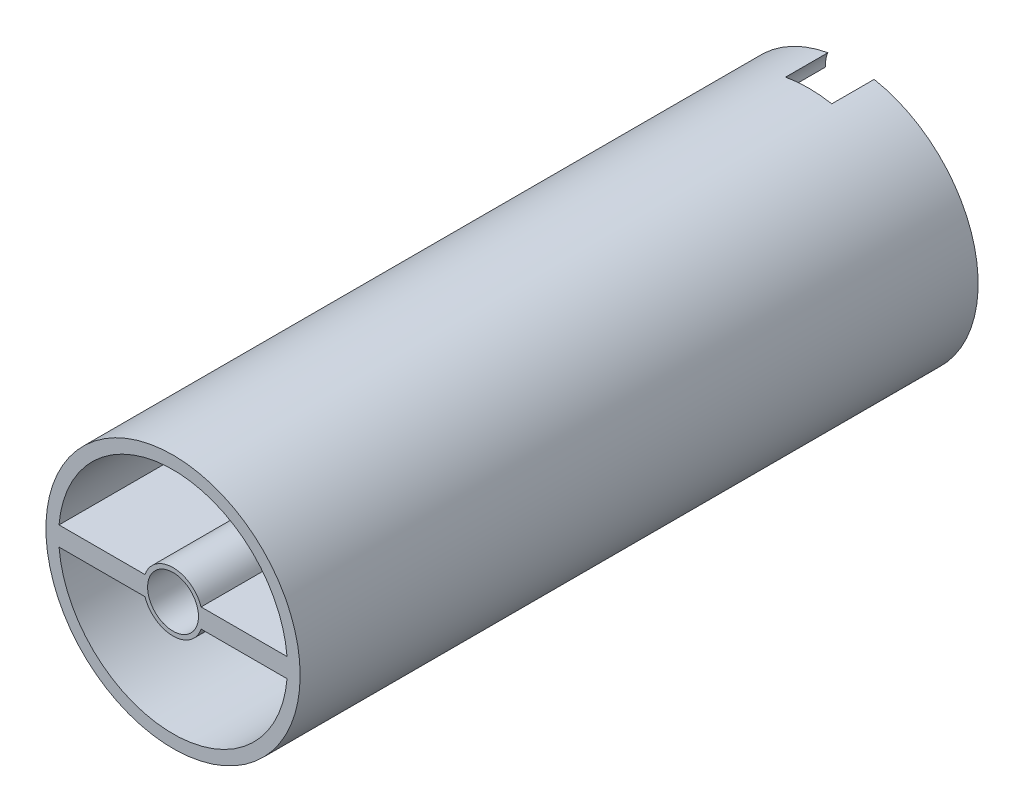
ISO-10303-21;
HEADER;
FILE_DESCRIPTION(('STEP AP214'),'2;1');
FILE_NAME('part.step','',(''),(''),'','','');
FILE_SCHEMA(('AUTOMOTIVE_DESIGN { 1 0 10303 214 1 1 1 1 }'));
ENDSEC;
DATA;
#1=APPLICATION_CONTEXT('core data for automotive mechanical design processes');
#2=APPLICATION_PROTOCOL_DEFINITION('international standard','automotive_design',2000,#1);
#3=PRODUCT_CONTEXT('',#1,'mechanical');
#4=PRODUCT('Part','Part','',(#3));
#5=PRODUCT_RELATED_PRODUCT_CATEGORY('part','',(#4));
#6=PRODUCT_DEFINITION_FORMATION('','',#4);
#7=PRODUCT_DEFINITION_CONTEXT('part definition',#1,'design');
#8=PRODUCT_DEFINITION('design','',#6,#7);
#9=PRODUCT_DEFINITION_SHAPE('','',#8);
#10=(LENGTH_UNIT() NAMED_UNIT(*) SI_UNIT(.MILLI.,.METRE.));
#11=(NAMED_UNIT(*) PLANE_ANGLE_UNIT() SI_UNIT($,.RADIAN.));
#12=(NAMED_UNIT(*) SI_UNIT($,.STERADIAN.) SOLID_ANGLE_UNIT());
#13=UNCERTAINTY_MEASURE_WITH_UNIT(LENGTH_MEASURE(1.E-05),#10,'distance_accuracy_value','');
#14=(GEOMETRIC_REPRESENTATION_CONTEXT(3) GLOBAL_UNCERTAINTY_ASSIGNED_CONTEXT((#13)) GLOBAL_UNIT_ASSIGNED_CONTEXT((#10,
#11,#12)) REPRESENTATION_CONTEXT('',''));
#15=CARTESIAN_POINT('',(0.,0.,0.));
#16=DIRECTION('',(0.,0.,1.));
#17=DIRECTION('',(1.,0.,0.));
#18=AXIS2_PLACEMENT_3D('',#15,#16,#17);
#19=CARTESIAN_POINT('',(0.,0.,80.));
#20=DIRECTION('',(0.,0.,-1.));
#21=DIRECTION('',(-1.,0.,0.));
#22=AXIS2_PLACEMENT_3D('',#19,#20,#21);
#23=CYLINDRICAL_SURFACE('',#22,13.5);
#24=CARTESIAN_POINT('',(0.,0.,0.));
#25=DIRECTION('',(0.,0.,1.));
#26=DIRECTION('',(1.,0.,0.));
#27=AXIS2_PLACEMENT_3D('',#24,#25,#26);
#28=CIRCLE('',#27,13.5);
#29=CARTESIAN_POINT('',(-2.98142396999973,13.1666666666667,0.));
#30=VERTEX_POINT('',#29);
#31=CARTESIAN_POINT('',(-13.4525879257289,1.13043270500024,0.));
#32=VERTEX_POINT('',#31);
#33=EDGE_CURVE('E331',#30,#32,#28,.T.);
#34=ORIENTED_EDGE('',*,*,#33,.F.);
#35=DIRECTION('',(0.,0.,-1.));
#36=VECTOR('',#35,1.);
#37=CARTESIAN_POINT('',(-2.98142396999973,13.1666666666667,5.));
#38=LINE('',#37,#36);
#39=CARTESIAN_POINT('',(-2.98142396999973,13.1666666666667,5.));
#40=VERTEX_POINT('',#39);
#41=EDGE_CURVE('E235',#40,#30,#38,.T.);
#42=ORIENTED_EDGE('',*,*,#41,.F.);
#43=CARTESIAN_POINT('',(0.,0.,5.));
#44=DIRECTION('',(0.,0.,1.));
#45=DIRECTION('',(1.,0.,0.));
#46=AXIS2_PLACEMENT_3D('',#43,#44,#45);
#47=CIRCLE('',#46,13.5);
#48=CARTESIAN_POINT('',(2.98142396999973,13.1666666666667,5.));
#49=VERTEX_POINT('',#48);
#50=EDGE_CURVE('E219',#49,#40,#47,.T.);
#51=ORIENTED_EDGE('',*,*,#50,.F.);
#52=DIRECTION('',(0.,0.,-1.));
#53=VECTOR('',#52,1.);
#54=CARTESIAN_POINT('',(2.98142396999973,13.1666666666667,5.));
#55=LINE('',#54,#53);
#56=CARTESIAN_POINT('',(2.98142396999973,13.1666666666667,0.));
#57=VERTEX_POINT('',#56);
#58=EDGE_CURVE('E251',#49,#57,#55,.T.);
#59=ORIENTED_EDGE('',*,*,#58,.T.);
#60=CARTESIAN_POINT('',(13.4525879257289,1.13043270500024,0.));
#61=VERTEX_POINT('',#60);
#62=EDGE_CURVE('E326',#61,#57,#28,.T.);
#63=ORIENTED_EDGE('',*,*,#62,.F.);
#64=DIRECTION('',(0.,0.,-1.));
#65=VECTOR('',#64,1.);
#66=CARTESIAN_POINT('',(13.4525879257289,1.13043270500024,80.));
#67=LINE('',#66,#65);
#68=CARTESIAN_POINT('',(13.4525879257289,1.13043270500024,55.));
#69=VERTEX_POINT('',#68);
#70=EDGE_CURVE('E388',#69,#61,#67,.T.);
#71=ORIENTED_EDGE('',*,*,#70,.F.);
#72=CARTESIAN_POINT('',(0.,0.,55.));
#73=DIRECTION('',(0.,0.,1.));
#74=DIRECTION('',(1.,0.,0.));
#75=AXIS2_PLACEMENT_3D('',#72,#73,#74);
#76=CIRCLE('',#75,13.5);
#77=CARTESIAN_POINT('',(-13.4525879257289,1.13043270500024,55.));
#78=VERTEX_POINT('',#77);
#79=EDGE_CURVE('E447',#69,#78,#76,.T.);
#80=ORIENTED_EDGE('',*,*,#79,.T.);
#81=DIRECTION('',(0.,0.,-1.));
#82=VECTOR('',#81,1.);
#83=CARTESIAN_POINT('',(-13.4525879257289,1.13043270500024,80.));
#84=LINE('',#83,#82);
#85=EDGE_CURVE('E320',#78,#32,#84,.T.);
#86=ORIENTED_EDGE('',*,*,#85,.T.);
#87=EDGE_LOOP('',(#34,#42,#51,#59,#63,#71,#80,#86));
#88=FACE_BOUND('',#87,.T.);
#89=ADVANCED_FACE('F48',(#88),#23,.F.);
#90=CARTESIAN_POINT('',(0.,0.,80.));
#91=DIRECTION('',(0.,0.,-1.));
#92=DIRECTION('',(-1.,0.,0.));
#93=AXIS2_PLACEMENT_3D('',#90,#91,#92);
#94=CYLINDRICAL_SURFACE('',#93,15.);
#95=CARTESIAN_POINT('',(0.,0.,80.));
#96=DIRECTION('',(0.,0.,1.));
#97=DIRECTION('',(1.,0.,0.));
#98=AXIS2_PLACEMENT_3D('',#95,#96,#97);
#99=CIRCLE('',#98,15.);
#100=CARTESIAN_POINT('',(15.,0.,80.));
#101=VERTEX_POINT('',#100);
#102=EDGE_CURVE('E286',#101,#101,#99,.T.);
#103=ORIENTED_EDGE('',*,*,#102,.F.);
#104=EDGE_LOOP('',(#103));
#105=FACE_BOUND('',#104,.T.);
#106=DIRECTION('',(0.,0.,-1.));
#107=VECTOR('',#106,1.);
#108=CARTESIAN_POINT('',(-2.72717802865893,14.75,5.));
#109=LINE('',#108,#107);
#110=CARTESIAN_POINT('',(-2.72717802865893,14.75,5.));
#111=VERTEX_POINT('',#110);
#112=CARTESIAN_POINT('',(-2.72717802865893,14.75,0.));
#113=VERTEX_POINT('',#112);
#114=EDGE_CURVE('E226',#111,#113,#109,.T.);
#115=ORIENTED_EDGE('',*,*,#114,.T.);
#116=CARTESIAN_POINT('',(0.,0.,0.));
#117=DIRECTION('',(0.,0.,1.));
#118=DIRECTION('',(1.,0.,0.));
#119=AXIS2_PLACEMENT_3D('',#116,#117,#118);
#120=CIRCLE('',#119,15.);
#121=CARTESIAN_POINT('',(-2.72717802865893,-14.75,0.));
#122=VERTEX_POINT('',#121);
#123=EDGE_CURVE('E324',#113,#122,#120,.T.);
#124=ORIENTED_EDGE('',*,*,#123,.T.);
#125=DIRECTION('',(0.,0.,-1.));
#126=VECTOR('',#125,1.);
#127=CARTESIAN_POINT('',(-2.72717802865893,-14.75,5.));
#128=LINE('',#127,#126);
#129=CARTESIAN_POINT('',(-2.72717802865893,-14.75,5.));
#130=VERTEX_POINT('',#129);
#131=EDGE_CURVE('E248',#130,#122,#128,.T.);
#132=ORIENTED_EDGE('',*,*,#131,.F.);
#133=CARTESIAN_POINT('',(0.,0.,5.));
#134=DIRECTION('',(0.,0.,1.));
#135=DIRECTION('',(1.,0.,0.));
#136=AXIS2_PLACEMENT_3D('',#133,#134,#135);
#137=CIRCLE('',#136,15.);
#138=CARTESIAN_POINT('',(2.72717802865893,-14.75,5.));
#139=VERTEX_POINT('',#138);
#140=EDGE_CURVE('E261',#130,#139,#137,.T.);
#141=ORIENTED_EDGE('',*,*,#140,.T.);
#142=DIRECTION('',(0.,0.,-1.));
#143=VECTOR('',#142,1.);
#144=CARTESIAN_POINT('',(2.72717802865893,-14.75,5.));
#145=LINE('',#144,#143);
#146=CARTESIAN_POINT('',(2.72717802865893,-14.75,0.));
#147=VERTEX_POINT('',#146);
#148=EDGE_CURVE('E280',#139,#147,#145,.T.);
#149=ORIENTED_EDGE('',*,*,#148,.T.);
#150=CARTESIAN_POINT('',(2.72717802865893,14.75,0.));
#151=VERTEX_POINT('',#150);
#152=EDGE_CURVE('E321',#147,#151,#120,.T.);
#153=ORIENTED_EDGE('',*,*,#152,.T.);
#154=DIRECTION('',(0.,0.,-1.));
#155=VECTOR('',#154,1.);
#156=CARTESIAN_POINT('',(2.72717802865893,14.75,5.));
#157=LINE('',#156,#155);
#158=CARTESIAN_POINT('',(2.72717802865893,14.75,5.));
#159=VERTEX_POINT('',#158);
#160=EDGE_CURVE('E74',#159,#151,#157,.T.);
#161=ORIENTED_EDGE('',*,*,#160,.F.);
#162=CARTESIAN_POINT('',(0.,0.,5.));
#163=DIRECTION('',(0.,0.,1.));
#164=DIRECTION('',(1.,0.,0.));
#165=AXIS2_PLACEMENT_3D('',#162,#163,#164);
#166=CIRCLE('',#165,15.);
#167=EDGE_CURVE('E217',#159,#111,#166,.T.);
#168=ORIENTED_EDGE('',*,*,#167,.T.);
#169=EDGE_LOOP('',(#115,#124,#132,#141,#149,#153,#161,#168));
#170=FACE_BOUND('',#169,.T.);
#171=ADVANCED_FACE('F237',(#105,#170),#94,.T.);
#172=CARTESIAN_POINT('',(0.,0.,0.));
#173=DIRECTION('',(0.,0.,1.));
#174=DIRECTION('',(1.,0.,0.));
#175=AXIS2_PLACEMENT_3D('',#172,#173,#174);
#176=PLANE('',#175);
#177=CARTESIAN_POINT('',(0.,0.,0.));
#178=DIRECTION('',(0.,0.,1.));
#179=DIRECTION('',(1.,0.,0.));
#180=AXIS2_PLACEMENT_3D('',#177,#178,#179);
#181=CIRCLE('',#180,3.);
#182=CARTESIAN_POINT('',(3.,0.,0.));
#183=VERTEX_POINT('',#182);
#184=EDGE_CURVE('E291',#183,#183,#181,.T.);
#185=ORIENTED_EDGE('',*,*,#184,.T.);
#186=EDGE_LOOP('',(#185));
#187=FACE_BOUND('',#186,.T.);
#188=CARTESIAN_POINT('',(0.,13.5,0.));
#189=DIRECTION('',(0.,0.,1.));
#190=DIRECTION('',(1.,0.,0.));
#191=AXIS2_PLACEMENT_3D('',#188,#189,#190);
#192=CIRCLE('',#191,3.);
#193=EDGE_CURVE('E229',#113,#30,#192,.T.);
#194=ORIENTED_EDGE('',*,*,#193,.T.);
#195=ORIENTED_EDGE('',*,*,#33,.T.);
#196=DIRECTION('',(1.,0.,0.));
#197=VECTOR('',#196,1.);
#198=CARTESIAN_POINT('',(0.,1.13043270500024,0.));
#199=LINE('',#198,#197);
#200=CARTESIAN_POINT('',(-3.31241934233361,1.13043270500024,0.));
#201=VERTEX_POINT('',#200);
#202=EDGE_CURVE('E341',#32,#201,#199,.T.);
#203=ORIENTED_EDGE('',*,*,#202,.T.);
#204=CARTESIAN_POINT('',(0.,0.,0.));
#205=DIRECTION('',(0.,0.,1.));
#206=DIRECTION('',(1.,0.,0.));
#207=AXIS2_PLACEMENT_3D('',#204,#205,#206);
#208=CIRCLE('',#207,3.5);
#209=CARTESIAN_POINT('',(3.31241934233361,1.13043270500024,0.));
#210=VERTEX_POINT('',#209);
#211=EDGE_CURVE('E337',#210,#201,#208,.T.);
#212=ORIENTED_EDGE('',*,*,#211,.F.);
#213=DIRECTION('',(1.,0.,0.));
#214=VECTOR('',#213,1.);
#215=CARTESIAN_POINT('',(0.,1.13043270500024,0.));
#216=LINE('',#215,#214);
#217=EDGE_CURVE('E330',#210,#61,#216,.T.);
#218=ORIENTED_EDGE('',*,*,#217,.T.);
#219=ORIENTED_EDGE('',*,*,#62,.T.);
#220=EDGE_CURVE('E240',#57,#151,#192,.T.);
#221=ORIENTED_EDGE('',*,*,#220,.T.);
#222=ORIENTED_EDGE('',*,*,#152,.F.);
#223=CARTESIAN_POINT('',(0.,-13.5,0.));
#224=DIRECTION('',(0.,0.,1.));
#225=DIRECTION('',(1.,0.,0.));
#226=AXIS2_PLACEMENT_3D('',#223,#224,#225);
#227=CIRCLE('',#226,3.);
#228=CARTESIAN_POINT('',(2.98142396999973,-13.1666666666667,0.));
#229=VERTEX_POINT('',#228);
#230=EDGE_CURVE('E262',#229,#147,#227,.F.);
#231=ORIENTED_EDGE('',*,*,#230,.F.);
#232=CARTESIAN_POINT('',(13.4525879257289,-1.13043270500035,0.));
#233=VERTEX_POINT('',#232);
#234=EDGE_CURVE('E332',#229,#233,#28,.T.);
#235=ORIENTED_EDGE('',*,*,#234,.T.);
#236=DIRECTION('',(1.,0.,0.));
#237=VECTOR('',#236,1.);
#238=CARTESIAN_POINT('',(0.,-1.13043270500035,0.));
#239=LINE('',#238,#237);
#240=CARTESIAN_POINT('',(3.31241934233361,-1.13043270500035,0.));
#241=VERTEX_POINT('',#240);
#242=EDGE_CURVE('E345',#241,#233,#239,.T.);
#243=ORIENTED_EDGE('',*,*,#242,.F.);
#244=CARTESIAN_POINT('',(0.,0.,0.));
#245=DIRECTION('',(0.,0.,1.));
#246=DIRECTION('',(1.,0.,0.));
#247=AXIS2_PLACEMENT_3D('',#244,#245,#246);
#248=CIRCLE('',#247,3.50000000000004);
#249=CARTESIAN_POINT('',(-3.31241934233361,-1.13043270500035,0.));
#250=VERTEX_POINT('',#249);
#251=EDGE_CURVE('E353',#250,#241,#248,.T.);
#252=ORIENTED_EDGE('',*,*,#251,.F.);
#253=DIRECTION('',(1.,0.,0.));
#254=VECTOR('',#253,1.);
#255=CARTESIAN_POINT('',(0.,-1.13043270500035,0.));
#256=LINE('',#255,#254);
#257=CARTESIAN_POINT('',(-13.4525879257289,-1.13043270500035,0.));
#258=VERTEX_POINT('',#257);
#259=EDGE_CURVE('E349',#258,#250,#256,.T.);
#260=ORIENTED_EDGE('',*,*,#259,.F.);
#261=CARTESIAN_POINT('',(-2.98142396999973,-13.1666666666667,0.));
#262=VERTEX_POINT('',#261);
#263=EDGE_CURVE('E333',#258,#262,#28,.T.);
#264=ORIENTED_EDGE('',*,*,#263,.T.);
#265=EDGE_CURVE('E272',#122,#262,#227,.F.);
#266=ORIENTED_EDGE('',*,*,#265,.F.);
#267=ORIENTED_EDGE('',*,*,#123,.F.);
#268=EDGE_LOOP('',(#194,#195,#203,#212,#218,#219,#221,#222,#231,#235,#243,#252,#260,#264,#266,#267));
#269=FACE_BOUND('',#268,.T.);
#270=ADVANCED_FACE('F513',(#187,#269),#176,.F.);
#271=CARTESIAN_POINT('',(0.,-1.13043270500035,80.));
#272=DIRECTION('',(0.,1.,0.));
#273=DIRECTION('',(0.,0.,1.));
#274=AXIS2_PLACEMENT_3D('',#271,#272,#273);
#275=PLANE('',#274);
#276=DIRECTION('',(1.,0.,0.));
#277=VECTOR('',#276,1.);
#278=CARTESIAN_POINT('',(0.,-1.13043270500035,55.));
#279=LINE('',#278,#277);
#280=CARTESIAN_POINT('',(3.31241934233361,-1.13043270500035,55.));
#281=VERTEX_POINT('',#280);
#282=CARTESIAN_POINT('',(13.4525879257289,-1.13043270500035,55.));
#283=VERTEX_POINT('',#282);
#284=EDGE_CURVE('E398',#281,#283,#279,.T.);
#285=ORIENTED_EDGE('',*,*,#284,.F.);
#286=DIRECTION('',(0.,0.,-1.));
#287=VECTOR('',#286,1.);
#288=CARTESIAN_POINT('',(3.31241934233361,-1.13043270500035,80.));
#289=LINE('',#288,#287);
#290=EDGE_CURVE('E365',#281,#241,#289,.T.);
#291=ORIENTED_EDGE('',*,*,#290,.T.);
#292=ORIENTED_EDGE('',*,*,#242,.T.);
#293=DIRECTION('',(0.,0.,-1.));
#294=VECTOR('',#293,1.);
#295=CARTESIAN_POINT('',(13.4525879257289,-1.13043270500035,80.));
#296=LINE('',#295,#294);
#297=EDGE_CURVE('E58',#283,#233,#296,.T.);
#298=ORIENTED_EDGE('',*,*,#297,.F.);
#299=EDGE_LOOP('',(#285,#291,#292,#298));
#300=FACE_BOUND('',#299,.T.);
#301=ADVANCED_FACE('F520',(#300),#275,.F.);
#302=DIRECTION('',(0.,0.,-1.));
#303=VECTOR('',#302,1.);
#304=CARTESIAN_POINT('',(-2.98142396999973,-13.1666666666667,5.));
#305=LINE('',#304,#303);
#306=CARTESIAN_POINT('',(-2.98142396999973,-13.1666666666667,5.));
#307=VERTEX_POINT('',#306);
#308=EDGE_CURVE('E271',#307,#262,#305,.T.);
#309=ORIENTED_EDGE('',*,*,#308,.T.);
#310=ORIENTED_EDGE('',*,*,#263,.F.);
#311=DIRECTION('',(0.,0.,-1.));
#312=VECTOR('',#311,1.);
#313=CARTESIAN_POINT('',(-13.4525879257289,-1.13043270500035,80.));
#314=LINE('',#313,#312);
#315=CARTESIAN_POINT('',(-13.4525879257289,-1.13043270500035,55.));
#316=VERTEX_POINT('',#315);
#317=EDGE_CURVE('E370',#316,#258,#314,.T.);
#318=ORIENTED_EDGE('',*,*,#317,.F.);
#319=CARTESIAN_POINT('',(0.,0.,55.));
#320=DIRECTION('',(0.,0.,1.));
#321=DIRECTION('',(1.,0.,0.));
#322=AXIS2_PLACEMENT_3D('',#319,#320,#321);
#323=CIRCLE('',#322,13.5);
#324=EDGE_CURVE('E412',#316,#283,#323,.T.);
#325=ORIENTED_EDGE('',*,*,#324,.T.);
#326=ORIENTED_EDGE('',*,*,#297,.T.);
#327=ORIENTED_EDGE('',*,*,#234,.F.);
#328=DIRECTION('',(0.,0.,-1.));
#329=VECTOR('',#328,1.);
#330=CARTESIAN_POINT('',(2.98142396999973,-13.1666666666667,5.));
#331=LINE('',#330,#329);
#332=CARTESIAN_POINT('',(2.98142396999973,-13.1666666666667,5.));
#333=VERTEX_POINT('',#332);
#334=EDGE_CURVE('E66',#333,#229,#331,.T.);
#335=ORIENTED_EDGE('',*,*,#334,.F.);
#336=CARTESIAN_POINT('',(0.,0.,5.));
#337=DIRECTION('',(0.,0.,1.));
#338=DIRECTION('',(1.,0.,0.));
#339=AXIS2_PLACEMENT_3D('',#336,#337,#338);
#340=CIRCLE('',#339,13.5);
#341=EDGE_CURVE('E267',#307,#333,#340,.T.);
#342=ORIENTED_EDGE('',*,*,#341,.F.);
#343=EDGE_LOOP('',(#309,#310,#318,#325,#326,#327,#335,#342));
#344=FACE_BOUND('',#343,.T.);
#345=ADVANCED_FACE('F507',(#344),#23,.F.);
#346=CARTESIAN_POINT('',(0.,-1.13043270500035,80.));
#347=DIRECTION('',(0.,1.,0.));
#348=DIRECTION('',(0.,0.,1.));
#349=AXIS2_PLACEMENT_3D('',#346,#347,#348);
#350=PLANE('',#349);
#351=DIRECTION('',(1.,0.,0.));
#352=VECTOR('',#351,1.);
#353=CARTESIAN_POINT('',(0.,-1.13043270500035,55.));
#354=LINE('',#353,#352);
#355=CARTESIAN_POINT('',(-3.31241934233361,-1.13043270500035,55.));
#356=VERTEX_POINT('',#355);
#357=EDGE_CURVE('E408',#316,#356,#354,.T.);
#358=ORIENTED_EDGE('',*,*,#357,.F.);
#359=ORIENTED_EDGE('',*,*,#317,.T.);
#360=ORIENTED_EDGE('',*,*,#259,.T.);
#361=DIRECTION('',(0.,0.,-1.));
#362=VECTOR('',#361,1.);
#363=CARTESIAN_POINT('',(-3.31241934233361,-1.13043270500035,80.));
#364=LINE('',#363,#362);
#365=EDGE_CURVE('E364',#356,#250,#364,.T.);
#366=ORIENTED_EDGE('',*,*,#365,.F.);
#367=EDGE_LOOP('',(#358,#359,#360,#366));
#368=FACE_BOUND('',#367,.T.);
#369=ADVANCED_FACE('F519',(#368),#350,.F.);
#370=CARTESIAN_POINT('',(0.,1.13043270500024,80.));
#371=DIRECTION('',(0.,1.,0.));
#372=DIRECTION('',(-1.,0.,0.));
#373=AXIS2_PLACEMENT_3D('',#370,#371,#372);
#374=PLANE('',#373);
#375=DIRECTION('',(0.,0.,-1.));
#376=VECTOR('',#375,1.);
#377=CARTESIAN_POINT('',(3.31241934233361,1.13043270500024,80.));
#378=LINE('',#377,#376);
#379=CARTESIAN_POINT('',(3.31241934233361,1.13043270500024,55.));
#380=VERTEX_POINT('',#379);
#381=EDGE_CURVE('E383',#380,#210,#378,.T.);
#382=ORIENTED_EDGE('',*,*,#381,.F.);
#383=DIRECTION('',(1.,0.,0.));
#384=VECTOR('',#383,1.);
#385=CARTESIAN_POINT('',(0.,1.13043270500024,55.));
#386=LINE('',#385,#384);
#387=EDGE_CURVE('E443',#380,#69,#386,.T.);
#388=ORIENTED_EDGE('',*,*,#387,.T.);
#389=ORIENTED_EDGE('',*,*,#70,.T.);
#390=ORIENTED_EDGE('',*,*,#217,.F.);
#391=EDGE_LOOP('',(#382,#388,#389,#390));
#392=FACE_BOUND('',#391,.T.);
#393=ADVANCED_FACE('F537',(#392),#374,.T.);
#394=CARTESIAN_POINT('',(0.,0.,80.));
#395=DIRECTION('',(0.,0.,-1.));
#396=DIRECTION('',(-1.,0.,0.));
#397=AXIS2_PLACEMENT_3D('',#394,#395,#396);
#398=CYLINDRICAL_SURFACE('',#397,3.5);
#399=CARTESIAN_POINT('',(0.,0.,55.));
#400=DIRECTION('',(0.,0.,1.));
#401=DIRECTION('',(1.,0.,0.));
#402=AXIS2_PLACEMENT_3D('',#399,#400,#401);
#403=CIRCLE('',#402,3.50000000000004);
#404=CARTESIAN_POINT('',(-3.31241934233361,1.13043270500024,55.));
#405=VERTEX_POINT('',#404);
#406=EDGE_CURVE('E403',#380,#405,#403,.T.);
#407=ORIENTED_EDGE('',*,*,#406,.F.);
#408=ORIENTED_EDGE('',*,*,#381,.T.);
#409=ORIENTED_EDGE('',*,*,#211,.T.);
#410=DIRECTION('',(0.,0.,-1.));
#411=VECTOR('',#410,1.);
#412=CARTESIAN_POINT('',(-3.31241934233361,1.13043270500024,80.));
#413=LINE('',#412,#411);
#414=EDGE_CURVE('E379',#405,#201,#413,.T.);
#415=ORIENTED_EDGE('',*,*,#414,.F.);
#416=EDGE_LOOP('',(#407,#408,#409,#415));
#417=FACE_BOUND('',#416,.T.);
#418=ADVANCED_FACE('F541',(#417),#398,.T.);
#419=CARTESIAN_POINT('',(0.,0.,80.));
#420=DIRECTION('',(0.,0.,-1.));
#421=DIRECTION('',(-1.,0.,0.));
#422=AXIS2_PLACEMENT_3D('',#419,#420,#421);
#423=CYLINDRICAL_SURFACE('',#422,3.50000000000004);
#424=CARTESIAN_POINT('',(0.,0.,55.));
#425=DIRECTION('',(0.,0.,1.));
#426=DIRECTION('',(1.,0.,0.));
#427=AXIS2_PLACEMENT_3D('',#424,#425,#426);
#428=CIRCLE('',#427,3.50000000000004);
#429=EDGE_CURVE('E234',#356,#281,#428,.T.);
#430=ORIENTED_EDGE('',*,*,#429,.F.);
#431=ORIENTED_EDGE('',*,*,#365,.T.);
#432=ORIENTED_EDGE('',*,*,#251,.T.);
#433=ORIENTED_EDGE('',*,*,#290,.F.);
#434=EDGE_LOOP('',(#430,#431,#432,#433));
#435=FACE_BOUND('',#434,.T.);
#436=ADVANCED_FACE('F498',(#435),#423,.T.);
#437=CARTESIAN_POINT('',(0.,1.13043270500024,80.));
#438=DIRECTION('',(0.,1.,0.));
#439=DIRECTION('',(-1.,0.,0.));
#440=AXIS2_PLACEMENT_3D('',#437,#438,#439);
#441=PLANE('',#440);
#442=ORIENTED_EDGE('',*,*,#85,.F.);
#443=DIRECTION('',(1.,0.,0.));
#444=VECTOR('',#443,1.);
#445=CARTESIAN_POINT('',(0.,1.13043270500024,55.));
#446=LINE('',#445,#444);
#447=EDGE_CURVE('E436',#78,#405,#446,.T.);
#448=ORIENTED_EDGE('',*,*,#447,.T.);
#449=ORIENTED_EDGE('',*,*,#414,.T.);
#450=ORIENTED_EDGE('',*,*,#202,.F.);
#451=EDGE_LOOP('',(#442,#448,#449,#450));
#452=FACE_BOUND('',#451,.T.);
#453=ADVANCED_FACE('F488',(#452),#441,.T.);
#454=CARTESIAN_POINT('',(3.31241934233361,-1.13043270500035,80.));
#455=VERTEX_POINT('',#454);
#456=CARTESIAN_POINT('',(3.31241934233361,-1.13043270500035,57.5));
#457=VERTEX_POINT('',#456);
#458=EDGE_CURVE('E360',#455,#457,#289,.T.);
#459=ORIENTED_EDGE('',*,*,#458,.T.);
#460=DIRECTION('',(1.,0.,0.));
#461=VECTOR('',#460,1.);
#462=CARTESIAN_POINT('',(0.,-1.13043270500035,57.5));
#463=LINE('',#462,#461);
#464=CARTESIAN_POINT('',(13.4525879257289,-1.13043270500035,57.5));
#465=VERTEX_POINT('',#464);
#466=EDGE_CURVE('E404',#457,#465,#463,.T.);
#467=ORIENTED_EDGE('',*,*,#466,.T.);
#468=CARTESIAN_POINT('',(13.4525879257289,-1.13043270500035,80.));
#469=VERTEX_POINT('',#468);
#470=EDGE_CURVE('E12',#469,#465,#296,.T.);
#471=ORIENTED_EDGE('',*,*,#470,.F.);
#472=DIRECTION('',(1.,0.,0.));
#473=VECTOR('',#472,1.);
#474=CARTESIAN_POINT('',(0.,-1.13043270500035,80.));
#475=LINE('',#474,#473);
#476=EDGE_CURVE('E307',#455,#469,#475,.T.);
#477=ORIENTED_EDGE('',*,*,#476,.F.);
#478=EDGE_LOOP('',(#459,#467,#471,#477));
#479=FACE_BOUND('',#478,.T.);
#480=ADVANCED_FACE('F502',(#479),#275,.F.);
#481=CARTESIAN_POINT('',(0.,0.,57.5));
#482=DIRECTION('',(0.,0.,1.));
#483=DIRECTION('',(1.,0.,0.));
#484=AXIS2_PLACEMENT_3D('',#481,#482,#483);
#485=CIRCLE('',#484,13.5);
#486=CARTESIAN_POINT('',(-13.4525879257289,-1.13043270500035,57.5));
#487=VERTEX_POINT('',#486);
#488=EDGE_CURVE('E425',#487,#465,#485,.T.);
#489=ORIENTED_EDGE('',*,*,#488,.F.);
#490=CARTESIAN_POINT('',(-13.4525879257289,-1.13043270500035,80.));
#491=VERTEX_POINT('',#490);
#492=EDGE_CURVE('E371',#491,#487,#314,.T.);
#493=ORIENTED_EDGE('',*,*,#492,.F.);
#494=CARTESIAN_POINT('',(0.,0.,80.));
#495=DIRECTION('',(0.,0.,1.));
#496=DIRECTION('',(1.,0.,0.));
#497=AXIS2_PLACEMENT_3D('',#494,#495,#496);
#498=CIRCLE('',#497,13.5);
#499=EDGE_CURVE('E296',#491,#469,#498,.T.);
#500=ORIENTED_EDGE('',*,*,#499,.T.);
#501=ORIENTED_EDGE('',*,*,#470,.T.);
#502=EDGE_LOOP('',(#489,#493,#500,#501));
#503=FACE_BOUND('',#502,.T.);
#504=ADVANCED_FACE('F508',(#503),#23,.F.);
#505=ORIENTED_EDGE('',*,*,#492,.T.);
#506=DIRECTION('',(1.,0.,0.));
#507=VECTOR('',#506,1.);
#508=CARTESIAN_POINT('',(0.,-1.13043270500035,57.5));
#509=LINE('',#508,#507);
#510=CARTESIAN_POINT('',(-3.31241934233361,-1.13043270500035,57.5));
#511=VERTEX_POINT('',#510);
#512=EDGE_CURVE('E421',#487,#511,#509,.T.);
#513=ORIENTED_EDGE('',*,*,#512,.T.);
#514=CARTESIAN_POINT('',(-3.31241934233361,-1.13043270500035,80.));
#515=VERTEX_POINT('',#514);
#516=EDGE_CURVE('E366',#515,#511,#364,.T.);
#517=ORIENTED_EDGE('',*,*,#516,.F.);
#518=DIRECTION('',(1.,0.,0.));
#519=VECTOR('',#518,1.);
#520=CARTESIAN_POINT('',(0.,-1.13043270500035,80.));
#521=LINE('',#520,#519);
#522=EDGE_CURVE('E310',#491,#515,#521,.T.);
#523=ORIENTED_EDGE('',*,*,#522,.F.);
#524=EDGE_LOOP('',(#505,#513,#517,#523));
#525=FACE_BOUND('',#524,.T.);
#526=ADVANCED_FACE('F523',(#525),#350,.F.);
#527=CARTESIAN_POINT('',(0.,0.,57.5));
#528=DIRECTION('',(0.,0.,1.));
#529=DIRECTION('',(1.,0.,0.));
#530=AXIS2_PLACEMENT_3D('',#527,#528,#529);
#531=CIRCLE('',#530,13.5);
#532=CARTESIAN_POINT('',(13.4525879257289,1.13043270500024,57.5));
#533=VERTEX_POINT('',#532);
#534=CARTESIAN_POINT('',(-13.4525879257289,1.13043270500024,57.5));
#535=VERTEX_POINT('',#534);
#536=EDGE_CURVE('E459',#533,#535,#531,.T.);
#537=ORIENTED_EDGE('',*,*,#536,.F.);
#538=CARTESIAN_POINT('',(13.4525879257289,1.13043270500024,80.));
#539=VERTEX_POINT('',#538);
#540=EDGE_CURVE('E389',#539,#533,#67,.T.);
#541=ORIENTED_EDGE('',*,*,#540,.F.);
#542=CARTESIAN_POINT('',(-13.4525879257289,1.13043270500024,80.));
#543=VERTEX_POINT('',#542);
#544=EDGE_CURVE('E290',#539,#543,#498,.T.);
#545=ORIENTED_EDGE('',*,*,#544,.T.);
#546=EDGE_CURVE('E375',#543,#535,#84,.T.);
#547=ORIENTED_EDGE('',*,*,#546,.T.);
#548=EDGE_LOOP('',(#537,#541,#545,#547));
#549=FACE_BOUND('',#548,.T.);
#550=ADVANCED_FACE('F481',(#549),#23,.F.);
#551=DIRECTION('',(1.,0.,0.));
#552=VECTOR('',#551,1.);
#553=CARTESIAN_POINT('',(0.,1.13043270500024,57.5));
#554=LINE('',#553,#552);
#555=CARTESIAN_POINT('',(3.31241934233361,1.13043270500024,57.5));
#556=VERTEX_POINT('',#555);
#557=EDGE_CURVE('E52',#556,#533,#554,.T.);
#558=ORIENTED_EDGE('',*,*,#557,.F.);
#559=CARTESIAN_POINT('',(3.31241934233361,1.13043270500024,80.));
#560=VERTEX_POINT('',#559);
#561=EDGE_CURVE('E384',#560,#556,#378,.T.);
#562=ORIENTED_EDGE('',*,*,#561,.F.);
#563=DIRECTION('',(1.,0.,0.));
#564=VECTOR('',#563,1.);
#565=CARTESIAN_POINT('',(0.,1.13043270500024,80.));
#566=LINE('',#565,#564);
#567=EDGE_CURVE('E295',#560,#539,#566,.T.);
#568=ORIENTED_EDGE('',*,*,#567,.T.);
#569=ORIENTED_EDGE('',*,*,#540,.T.);
#570=EDGE_LOOP('',(#558,#562,#568,#569));
#571=FACE_BOUND('',#570,.T.);
#572=ADVANCED_FACE('F469',(#571),#374,.T.);
#573=ORIENTED_EDGE('',*,*,#561,.T.);
#574=CARTESIAN_POINT('',(0.,0.,57.5));
#575=DIRECTION('',(0.,0.,1.));
#576=DIRECTION('',(1.,0.,0.));
#577=AXIS2_PLACEMENT_3D('',#574,#575,#576);
#578=CIRCLE('',#577,3.50000000000004);
#579=CARTESIAN_POINT('',(-3.31241934233361,1.13043270500024,57.5));
#580=VERTEX_POINT('',#579);
#581=EDGE_CURVE('E435',#556,#580,#578,.T.);
#582=ORIENTED_EDGE('',*,*,#581,.T.);
#583=CARTESIAN_POINT('',(-3.31241934233361,1.13043270500024,80.));
#584=VERTEX_POINT('',#583);
#585=EDGE_CURVE('E380',#584,#580,#413,.T.);
#586=ORIENTED_EDGE('',*,*,#585,.F.);
#587=CARTESIAN_POINT('',(0.,0.,80.));
#588=DIRECTION('',(0.,0.,1.));
#589=DIRECTION('',(1.,0.,0.));
#590=AXIS2_PLACEMENT_3D('',#587,#588,#589);
#591=CIRCLE('',#590,3.5);
#592=EDGE_CURVE('E300',#560,#584,#591,.T.);
#593=ORIENTED_EDGE('',*,*,#592,.F.);
#594=EDGE_LOOP('',(#573,#582,#586,#593));
#595=FACE_BOUND('',#594,.T.);
#596=ADVANCED_FACE('F472',(#595),#398,.T.);
#597=ORIENTED_EDGE('',*,*,#516,.T.);
#598=CARTESIAN_POINT('',(0.,0.,57.5));
#599=DIRECTION('',(0.,0.,1.));
#600=DIRECTION('',(1.,0.,0.));
#601=AXIS2_PLACEMENT_3D('',#598,#599,#600);
#602=CIRCLE('',#601,3.50000000000004);
#603=EDGE_CURVE('E397',#511,#457,#602,.T.);
#604=ORIENTED_EDGE('',*,*,#603,.T.);
#605=ORIENTED_EDGE('',*,*,#458,.F.);
#606=CARTESIAN_POINT('',(0.,0.,80.));
#607=DIRECTION('',(0.,0.,1.));
#608=DIRECTION('',(1.,0.,0.));
#609=AXIS2_PLACEMENT_3D('',#606,#607,#608);
#610=CIRCLE('',#609,3.50000000000004);
#611=EDGE_CURVE('E313',#515,#455,#610,.T.);
#612=ORIENTED_EDGE('',*,*,#611,.F.);
#613=EDGE_LOOP('',(#597,#604,#605,#612));
#614=FACE_BOUND('',#613,.T.);
#615=ADVANCED_FACE('F486',(#614),#423,.T.);
#616=DIRECTION('',(1.,0.,0.));
#617=VECTOR('',#616,1.);
#618=CARTESIAN_POINT('',(0.,1.13043270500024,57.5));
#619=LINE('',#618,#617);
#620=EDGE_CURVE('E440',#535,#580,#619,.T.);
#621=ORIENTED_EDGE('',*,*,#620,.F.);
#622=ORIENTED_EDGE('',*,*,#546,.F.);
#623=DIRECTION('',(1.,0.,0.));
#624=VECTOR('',#623,1.);
#625=CARTESIAN_POINT('',(0.,1.13043270500024,80.));
#626=LINE('',#625,#624);
#627=EDGE_CURVE('E303',#543,#584,#626,.T.);
#628=ORIENTED_EDGE('',*,*,#627,.T.);
#629=ORIENTED_EDGE('',*,*,#585,.T.);
#630=EDGE_LOOP('',(#621,#622,#628,#629));
#631=FACE_BOUND('',#630,.T.);
#632=ADVANCED_FACE('F483',(#631),#441,.T.);
#633=CARTESIAN_POINT('',(0.,0.,80.));
#634=DIRECTION('',(0.,0.,-1.));
#635=DIRECTION('',(-1.,0.,0.));
#636=AXIS2_PLACEMENT_3D('',#633,#634,#635);
#637=CYLINDRICAL_SURFACE('',#636,3.);
#638=CARTESIAN_POINT('',(0.,0.,80.));
#639=DIRECTION('',(0.,0.,1.));
#640=DIRECTION('',(1.,0.,0.));
#641=AXIS2_PLACEMENT_3D('',#638,#639,#640);
#642=CIRCLE('',#641,3.);
#643=CARTESIAN_POINT('',(3.,0.,80.));
#644=VERTEX_POINT('',#643);
#645=EDGE_CURVE('E316',#644,#644,#642,.T.);
#646=ORIENTED_EDGE('',*,*,#645,.T.);
#647=EDGE_LOOP('',(#646));
#648=FACE_BOUND('',#647,.T.);
#649=ORIENTED_EDGE('',*,*,#184,.F.);
#650=EDGE_LOOP('',(#649));
#651=FACE_BOUND('',#650,.T.);
#652=ADVANCED_FACE('F485',(#648,#651),#637,.F.);
#653=CARTESIAN_POINT('',(0.,0.,80.));
#654=DIRECTION('',(0.,0.,1.));
#655=DIRECTION('',(1.,0.,0.));
#656=AXIS2_PLACEMENT_3D('',#653,#654,#655);
#657=PLANE('',#656);
#658=ORIENTED_EDGE('',*,*,#102,.T.);
#659=EDGE_LOOP('',(#658));
#660=FACE_BOUND('',#659,.T.);
#661=ORIENTED_EDGE('',*,*,#544,.F.);
#662=ORIENTED_EDGE('',*,*,#567,.F.);
#663=ORIENTED_EDGE('',*,*,#592,.T.);
#664=ORIENTED_EDGE('',*,*,#627,.F.);
#665=EDGE_LOOP('',(#661,#662,#663,#664));
#666=FACE_BOUND('',#665,.T.);
#667=ORIENTED_EDGE('',*,*,#476,.T.);
#668=ORIENTED_EDGE('',*,*,#499,.F.);
#669=ORIENTED_EDGE('',*,*,#522,.T.);
#670=ORIENTED_EDGE('',*,*,#611,.T.);
#671=EDGE_LOOP('',(#667,#668,#669,#670));
#672=FACE_BOUND('',#671,.T.);
#673=ORIENTED_EDGE('',*,*,#645,.F.);
#674=EDGE_LOOP('',(#673));
#675=FACE_BOUND('',#674,.T.);
#676=ADVANCED_FACE('F478',(#660,#666,#672,#675),#657,.T.);
#677=CARTESIAN_POINT('',(0.,8.00000000000004,57.5));
#678=DIRECTION('',(0.,0.,-1.));
#679=DIRECTION('',(-1.,0.,0.));
#680=AXIS2_PLACEMENT_3D('',#677,#678,#679);
#681=CYLINDRICAL_SURFACE('',#680,2.75);
#682=CARTESIAN_POINT('',(0.,8.00000000000004,57.5));
#683=DIRECTION('',(0.,0.,1.));
#684=DIRECTION('',(1.,0.,0.));
#685=AXIS2_PLACEMENT_3D('',#682,#683,#684);
#686=CIRCLE('',#685,2.75);
#687=CARTESIAN_POINT('',(2.75,8.00000000000004,57.5));
#688=VERTEX_POINT('',#687);
#689=EDGE_CURVE('E325',#688,#688,#686,.T.);
#690=ORIENTED_EDGE('',*,*,#689,.T.);
#691=EDGE_LOOP('',(#690));
#692=FACE_BOUND('',#691,.T.);
#693=CARTESIAN_POINT('',(0.,8.00000000000004,55.));
#694=DIRECTION('',(0.,0.,1.));
#695=DIRECTION('',(1.,0.,0.));
#696=AXIS2_PLACEMENT_3D('',#693,#694,#695);
#697=CIRCLE('',#696,2.75);
#698=CARTESIAN_POINT('',(2.75,8.00000000000004,55.));
#699=VERTEX_POINT('',#698);
#700=EDGE_CURVE('E431',#699,#699,#697,.T.);
#701=ORIENTED_EDGE('',*,*,#700,.F.);
#702=EDGE_LOOP('',(#701));
#703=FACE_BOUND('',#702,.T.);
#704=ADVANCED_FACE('F50',(#692,#703),#681,.F.);
#705=CARTESIAN_POINT('',(0.,0.,57.5));
#706=DIRECTION('',(0.,0.,1.));
#707=DIRECTION('',(1.,0.,0.));
#708=AXIS2_PLACEMENT_3D('',#705,#706,#707);
#709=PLANE('',#708);
#710=ORIENTED_EDGE('',*,*,#581,.F.);
#711=ORIENTED_EDGE('',*,*,#557,.T.);
#712=ORIENTED_EDGE('',*,*,#536,.T.);
#713=ORIENTED_EDGE('',*,*,#620,.T.);
#714=EDGE_LOOP('',(#710,#711,#712,#713));
#715=FACE_BOUND('',#714,.T.);
#716=ORIENTED_EDGE('',*,*,#689,.F.);
#717=EDGE_LOOP('',(#716));
#718=FACE_BOUND('',#717,.T.);
#719=ADVANCED_FACE('F466',(#715,#718),#709,.T.);
#720=CARTESIAN_POINT('',(0.,0.,55.));
#721=DIRECTION('',(0.,0.,1.));
#722=DIRECTION('',(1.,0.,0.));
#723=AXIS2_PLACEMENT_3D('',#720,#721,#722);
#724=PLANE('',#723);
#725=ORIENTED_EDGE('',*,*,#406,.T.);
#726=ORIENTED_EDGE('',*,*,#447,.F.);
#727=ORIENTED_EDGE('',*,*,#79,.F.);
#728=ORIENTED_EDGE('',*,*,#387,.F.);
#729=EDGE_LOOP('',(#725,#726,#727,#728));
#730=FACE_BOUND('',#729,.T.);
#731=ORIENTED_EDGE('',*,*,#700,.T.);
#732=EDGE_LOOP('',(#731));
#733=FACE_BOUND('',#732,.T.);
#734=ADVANCED_FACE('F588',(#730,#733),#724,.F.);
#735=CARTESIAN_POINT('',(0.,-8.00000000000004,57.5));
#736=DIRECTION('',(0.,0.,-1.));
#737=DIRECTION('',(-1.,0.,0.));
#738=AXIS2_PLACEMENT_3D('',#735,#736,#737);
#739=CYLINDRICAL_SURFACE('',#738,2.75);
#740=CARTESIAN_POINT('',(0.,-8.00000000000004,57.5));
#741=DIRECTION('',(0.,0.,1.));
#742=DIRECTION('',(1.,0.,0.));
#743=AXIS2_PLACEMENT_3D('',#740,#741,#742);
#744=CIRCLE('',#743,2.75);
#745=CARTESIAN_POINT('',(2.75,-8.00000000000004,57.5));
#746=VERTEX_POINT('',#745);
#747=EDGE_CURVE('E399',#746,#746,#744,.T.);
#748=ORIENTED_EDGE('',*,*,#747,.T.);
#749=EDGE_LOOP('',(#748));
#750=FACE_BOUND('',#749,.T.);
#751=CARTESIAN_POINT('',(0.,-8.00000000000004,55.));
#752=DIRECTION('',(0.,0.,1.));
#753=DIRECTION('',(1.,0.,0.));
#754=AXIS2_PLACEMENT_3D('',#751,#752,#753);
#755=CIRCLE('',#754,2.75);
#756=CARTESIAN_POINT('',(2.75,-8.00000000000004,55.));
#757=VERTEX_POINT('',#756);
#758=EDGE_CURVE('E393',#757,#757,#755,.T.);
#759=ORIENTED_EDGE('',*,*,#758,.F.);
#760=EDGE_LOOP('',(#759));
#761=FACE_BOUND('',#760,.T.);
#762=ADVANCED_FACE('F610',(#750,#761),#739,.F.);
#763=CARTESIAN_POINT('',(0.,0.,57.5));
#764=DIRECTION('',(0.,0.,1.));
#765=DIRECTION('',(1.,0.,0.));
#766=AXIS2_PLACEMENT_3D('',#763,#764,#765);
#767=PLANE('',#766);
#768=ORIENTED_EDGE('',*,*,#603,.F.);
#769=ORIENTED_EDGE('',*,*,#512,.F.);
#770=ORIENTED_EDGE('',*,*,#488,.T.);
#771=ORIENTED_EDGE('',*,*,#466,.F.);
#772=EDGE_LOOP('',(#768,#769,#770,#771));
#773=FACE_BOUND('',#772,.T.);
#774=ORIENTED_EDGE('',*,*,#747,.F.);
#775=EDGE_LOOP('',(#774));
#776=FACE_BOUND('',#775,.T.);
#777=ADVANCED_FACE('F606',(#773,#776),#767,.T.);
#778=CARTESIAN_POINT('',(0.,0.,55.));
#779=DIRECTION('',(0.,0.,1.));
#780=DIRECTION('',(1.,0.,0.));
#781=AXIS2_PLACEMENT_3D('',#778,#779,#780);
#782=PLANE('',#781);
#783=ORIENTED_EDGE('',*,*,#429,.T.);
#784=ORIENTED_EDGE('',*,*,#284,.T.);
#785=ORIENTED_EDGE('',*,*,#324,.F.);
#786=ORIENTED_EDGE('',*,*,#357,.T.);
#787=EDGE_LOOP('',(#783,#784,#785,#786));
#788=FACE_BOUND('',#787,.T.);
#789=ORIENTED_EDGE('',*,*,#758,.T.);
#790=EDGE_LOOP('',(#789));
#791=FACE_BOUND('',#790,.T.);
#792=ADVANCED_FACE('F604',(#788,#791),#782,.F.);
#793=CARTESIAN_POINT('',(0.,-13.5,5.));
#794=DIRECTION('',(0.,0.,-1.));
#795=DIRECTION('',(-1.,0.,0.));
#796=AXIS2_PLACEMENT_3D('',#793,#794,#795);
#797=CYLINDRICAL_SURFACE('',#796,3.);
#798=ORIENTED_EDGE('',*,*,#265,.T.);
#799=ORIENTED_EDGE('',*,*,#308,.F.);
#800=CARTESIAN_POINT('',(0.,-13.5,5.));
#801=DIRECTION('',(0.,0.,1.));
#802=DIRECTION('',(1.,0.,0.));
#803=AXIS2_PLACEMENT_3D('',#800,#801,#802);
#804=CIRCLE('',#803,3.);
#805=EDGE_CURVE('E257',#130,#307,#804,.F.);
#806=ORIENTED_EDGE('',*,*,#805,.F.);
#807=ORIENTED_EDGE('',*,*,#131,.T.);
#808=EDGE_LOOP('',(#798,#799,#806,#807));
#809=FACE_BOUND('',#808,.T.);
#810=ADVANCED_FACE('F573',(#809),#797,.F.);
#811=ORIENTED_EDGE('',*,*,#230,.T.);
#812=ORIENTED_EDGE('',*,*,#148,.F.);
#813=EDGE_CURVE('E263',#333,#139,#804,.F.);
#814=ORIENTED_EDGE('',*,*,#813,.F.);
#815=ORIENTED_EDGE('',*,*,#334,.T.);
#816=EDGE_LOOP('',(#811,#812,#814,#815));
#817=FACE_BOUND('',#816,.T.);
#818=ADVANCED_FACE('F638',(#817),#797,.F.);
#819=CARTESIAN_POINT('',(0.,0.,5.));
#820=DIRECTION('',(0.,0.,1.));
#821=DIRECTION('',(1.,0.,0.));
#822=AXIS2_PLACEMENT_3D('',#819,#820,#821);
#823=PLANE('',#822);
#824=ORIENTED_EDGE('',*,*,#805,.T.);
#825=ORIENTED_EDGE('',*,*,#341,.T.);
#826=ORIENTED_EDGE('',*,*,#813,.T.);
#827=ORIENTED_EDGE('',*,*,#140,.F.);
#828=EDGE_LOOP('',(#824,#825,#826,#827));
#829=FACE_BOUND('',#828,.T.);
#830=ADVANCED_FACE('F580',(#829),#823,.F.);
#831=CARTESIAN_POINT('',(0.,13.5,5.));
#832=DIRECTION('',(0.,0.,-1.));
#833=DIRECTION('',(-1.,0.,0.));
#834=AXIS2_PLACEMENT_3D('',#831,#832,#833);
#835=CYLINDRICAL_SURFACE('',#834,3.);
#836=ORIENTED_EDGE('',*,*,#193,.F.);
#837=ORIENTED_EDGE('',*,*,#114,.F.);
#838=CARTESIAN_POINT('',(0.,13.5,5.));
#839=DIRECTION('',(0.,0.,1.));
#840=DIRECTION('',(1.,0.,0.));
#841=AXIS2_PLACEMENT_3D('',#838,#839,#840);
#842=CIRCLE('',#841,3.);
#843=EDGE_CURVE('E212',#111,#40,#842,.T.);
#844=ORIENTED_EDGE('',*,*,#843,.T.);
#845=ORIENTED_EDGE('',*,*,#41,.T.);
#846=EDGE_LOOP('',(#836,#837,#844,#845));
#847=FACE_BOUND('',#846,.T.);
#848=ADVANCED_FACE('F227',(#847),#835,.F.);
#849=ORIENTED_EDGE('',*,*,#220,.F.);
#850=ORIENTED_EDGE('',*,*,#58,.F.);
#851=EDGE_CURVE('E224',#49,#159,#842,.T.);
#852=ORIENTED_EDGE('',*,*,#851,.T.);
#853=ORIENTED_EDGE('',*,*,#160,.T.);
#854=EDGE_LOOP('',(#849,#850,#852,#853));
#855=FACE_BOUND('',#854,.T.);
#856=ADVANCED_FACE('F583',(#855),#835,.F.);
#857=CARTESIAN_POINT('',(0.,0.,5.));
#858=DIRECTION('',(0.,0.,1.));
#859=DIRECTION('',(1.,0.,0.));
#860=AXIS2_PLACEMENT_3D('',#857,#858,#859);
#861=PLANE('',#860);
#862=ORIENTED_EDGE('',*,*,#167,.F.);
#863=ORIENTED_EDGE('',*,*,#851,.F.);
#864=ORIENTED_EDGE('',*,*,#50,.T.);
#865=ORIENTED_EDGE('',*,*,#843,.F.);
#866=EDGE_LOOP('',(#862,#863,#864,#865));
#867=FACE_BOUND('',#866,.T.);
#868=ADVANCED_FACE('F214',(#867),#861,.F.);
#869=CLOSED_SHELL('',(#89,#171,#270,#301,#345,#369,#393,#418,#436,#453,#480,#504,#526,#550,#572,
#596,#615,#632,#652,#676,#704,#719,#734,#762,#777,#792,#810,#818,#830,#848,#856,#868));
#870=MANIFOLD_SOLID_BREP('B2',#869);
#871=ADVANCED_BREP_SHAPE_REPRESENTATION('',(#18,#870),#14);
#872=SHAPE_DEFINITION_REPRESENTATION(#9,#871);
ENDSEC;
END-ISO-10303-21;
